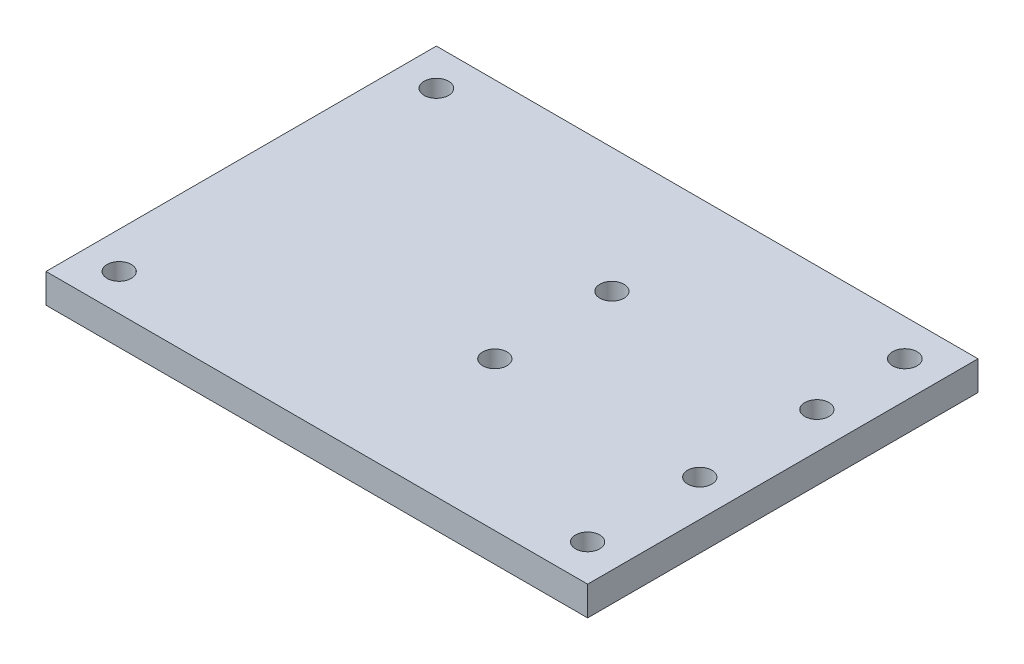
ISO-10303-21;
HEADER;
FILE_DESCRIPTION(('STEP AP214'),'2;1');
FILE_NAME('part.step','',(''),(''),'','','');
FILE_SCHEMA(('AUTOMOTIVE_DESIGN { 1 0 10303 214 1 1 1 1 }'));
ENDSEC;
DATA;
#1=APPLICATION_CONTEXT('core data for automotive mechanical design processes');
#2=APPLICATION_PROTOCOL_DEFINITION('international standard','automotive_design',2000,#1);
#3=PRODUCT_CONTEXT('',#1,'mechanical');
#4=PRODUCT('Part','Part','',(#3));
#5=PRODUCT_RELATED_PRODUCT_CATEGORY('part','',(#4));
#6=PRODUCT_DEFINITION_FORMATION('','',#4);
#7=PRODUCT_DEFINITION_CONTEXT('part definition',#1,'design');
#8=PRODUCT_DEFINITION('design','',#6,#7);
#9=PRODUCT_DEFINITION_SHAPE('','',#8);
#10=(LENGTH_UNIT() NAMED_UNIT(*) SI_UNIT(.MILLI.,.METRE.));
#11=(NAMED_UNIT(*) PLANE_ANGLE_UNIT() SI_UNIT($,.RADIAN.));
#12=(NAMED_UNIT(*) SI_UNIT($,.STERADIAN.) SOLID_ANGLE_UNIT());
#13=UNCERTAINTY_MEASURE_WITH_UNIT(LENGTH_MEASURE(1.E-05),#10,'distance_accuracy_value','');
#14=(GEOMETRIC_REPRESENTATION_CONTEXT(3) GLOBAL_UNCERTAINTY_ASSIGNED_CONTEXT((#13)) GLOBAL_UNIT_ASSIGNED_CONTEXT((#10,
#11,#12)) REPRESENTATION_CONTEXT('',''));
#15=CARTESIAN_POINT('',(0.,0.,0.));
#16=DIRECTION('',(0.,0.,1.));
#17=DIRECTION('',(1.,0.,0.));
#18=AXIS2_PLACEMENT_3D('',#15,#16,#17);
#19=CARTESIAN_POINT('',(0.,6.35,0.));
#20=DIRECTION('',(0.,-1.,0.));
#21=DIRECTION('',(0.,0.,-1.));
#22=AXIS2_PLACEMENT_3D('',#19,#20,#21);
#23=PLANE('',#22);
#24=CARTESIAN_POINT('',(65.0875,6.35,-32.2567904141238));
#25=DIRECTION('',(0.,1.,0.));
#26=DIRECTION('',(0.,0.,1.));
#27=AXIS2_PLACEMENT_3D('',#24,#25,#26);
#28=CIRCLE('',#27,2.62890000000001);
#29=CARTESIAN_POINT('',(65.0875,6.35,-29.6278904141238));
#30=VERTEX_POINT('',#29);
#31=EDGE_CURVE('E169',#30,#30,#28,.T.);
#32=ORIENTED_EDGE('',*,*,#31,.F.);
#33=EDGE_LOOP('',(#32));
#34=FACE_BOUND('',#33,.T.);
#35=CARTESIAN_POINT('',(65.0875,6.35,-57.6567904141238));
#36=DIRECTION('',(0.,1.,0.));
#37=DIRECTION('',(0.,0.,1.));
#38=AXIS2_PLACEMENT_3D('',#35,#36,#37);
#39=CIRCLE('',#38,2.62890000000001);
#40=CARTESIAN_POINT('',(65.0875,6.35,-55.0278904141238));
#41=VERTEX_POINT('',#40);
#42=EDGE_CURVE('E177',#41,#41,#39,.T.);
#43=ORIENTED_EDGE('',*,*,#42,.F.);
#44=EDGE_LOOP('',(#43));
#45=FACE_BOUND('',#44,.T.);
#46=CARTESIAN_POINT('',(109.5375,6.35,-57.6567904141238));
#47=DIRECTION('',(0.,1.,0.));
#48=DIRECTION('',(0.,0.,1.));
#49=AXIS2_PLACEMENT_3D('',#46,#47,#48);
#50=CIRCLE('',#49,2.62890000000001);
#51=CARTESIAN_POINT('',(109.5375,6.35,-55.0278904141238));
#52=VERTEX_POINT('',#51);
#53=EDGE_CURVE('E185',#52,#52,#50,.T.);
#54=ORIENTED_EDGE('',*,*,#53,.F.);
#55=EDGE_LOOP('',(#54));
#56=FACE_BOUND('',#55,.T.);
#57=CARTESIAN_POINT('',(109.5375,6.35,-32.2567904141238));
#58=DIRECTION('',(0.,1.,0.));
#59=DIRECTION('',(0.,0.,1.));
#60=AXIS2_PLACEMENT_3D('',#57,#58,#59);
#61=CIRCLE('',#60,2.62890000000001);
#62=CARTESIAN_POINT('',(109.5375,6.35,-29.6278904141238));
#63=VERTEX_POINT('',#62);
#64=EDGE_CURVE('E161',#63,#63,#61,.T.);
#65=ORIENTED_EDGE('',*,*,#64,.F.);
#66=EDGE_LOOP('',(#65));
#67=FACE_BOUND('',#66,.T.);
#68=DIRECTION('',(0.,0.,1.));
#69=VECTOR('',#68,1.);
#70=CARTESIAN_POINT('',(0.,6.35,0.));
#71=LINE('',#70,#69);
#72=CARTESIAN_POINT('',(0.,6.35,-84.668868));
#73=VERTEX_POINT('',#72);
#74=CARTESIAN_POINT('',(0.,6.35,0.));
#75=VERTEX_POINT('',#74);
#76=EDGE_CURVE('E91',#73,#75,#71,.T.);
#77=ORIENTED_EDGE('',*,*,#76,.T.);
#78=DIRECTION('',(1.,0.,0.));
#79=VECTOR('',#78,1.);
#80=CARTESIAN_POINT('',(0.,6.35,0.));
#81=LINE('',#80,#79);
#82=CARTESIAN_POINT('',(117.475,6.35,0.));
#83=VERTEX_POINT('',#82);
#84=EDGE_CURVE('E86',#75,#83,#81,.T.);
#85=ORIENTED_EDGE('',*,*,#84,.T.);
#86=DIRECTION('',(0.,0.,-1.));
#87=VECTOR('',#86,1.);
#88=CARTESIAN_POINT('',(117.475,6.35,0.));
#89=LINE('',#88,#87);
#90=CARTESIAN_POINT('',(117.475,6.35,-84.668868));
#91=VERTEX_POINT('',#90);
#92=EDGE_CURVE('E89',#83,#91,#89,.T.);
#93=ORIENTED_EDGE('',*,*,#92,.T.);
#94=DIRECTION('',(-1.,0.,0.));
#95=VECTOR('',#94,1.);
#96=CARTESIAN_POINT('',(0.,6.35,-84.668868));
#97=LINE('',#96,#95);
#98=EDGE_CURVE('E56',#91,#73,#97,.T.);
#99=ORIENTED_EDGE('',*,*,#98,.T.);
#100=EDGE_LOOP('',(#77,#85,#93,#99));
#101=FACE_BOUND('',#100,.T.);
#102=CARTESIAN_POINT('',(7.9375,6.35,-7.9375));
#103=DIRECTION('',(0.,1.,0.));
#104=DIRECTION('',(0.,0.,1.));
#105=AXIS2_PLACEMENT_3D('',#102,#103,#104);
#106=CIRCLE('',#105,2.6289);
#107=CARTESIAN_POINT('',(7.9375,6.35,-5.3086));
#108=VERTEX_POINT('',#107);
#109=EDGE_CURVE('E111',#108,#108,#106,.T.);
#110=ORIENTED_EDGE('',*,*,#109,.F.);
#111=EDGE_LOOP('',(#110));
#112=FACE_BOUND('',#111,.T.);
#113=CARTESIAN_POINT('',(109.5375,6.35,-7.9375));
#114=DIRECTION('',(0.,1.,0.));
#115=DIRECTION('',(0.,0.,1.));
#116=AXIS2_PLACEMENT_3D('',#113,#114,#115);
#117=CIRCLE('',#116,2.62890000000001);
#118=CARTESIAN_POINT('',(109.5375,6.35,-5.30859999999999));
#119=VERTEX_POINT('',#118);
#120=EDGE_CURVE('E133',#119,#119,#117,.T.);
#121=ORIENTED_EDGE('',*,*,#120,.F.);
#122=EDGE_LOOP('',(#121));
#123=FACE_BOUND('',#122,.T.);
#124=CARTESIAN_POINT('',(7.9375,6.35,-76.731368));
#125=DIRECTION('',(0.,1.,0.));
#126=DIRECTION('',(0.,0.,1.));
#127=AXIS2_PLACEMENT_3D('',#124,#125,#126);
#128=CIRCLE('',#127,2.667);
#129=CARTESIAN_POINT('',(7.9375,6.35,-74.064368));
#130=VERTEX_POINT('',#129);
#131=EDGE_CURVE('E141',#130,#130,#128,.T.);
#132=ORIENTED_EDGE('',*,*,#131,.F.);
#133=EDGE_LOOP('',(#132));
#134=FACE_BOUND('',#133,.T.);
#135=CARTESIAN_POINT('',(109.5375,6.35,-76.731368));
#136=DIRECTION('',(0.,1.,0.));
#137=DIRECTION('',(0.,0.,-1.));
#138=AXIS2_PLACEMENT_3D('',#135,#136,#137);
#139=CIRCLE('',#138,2.667);
#140=CARTESIAN_POINT('',(109.5375,6.35,-79.398368));
#141=VERTEX_POINT('',#140);
#142=EDGE_CURVE('E149',#141,#141,#139,.T.);
#143=ORIENTED_EDGE('',*,*,#142,.F.);
#144=EDGE_LOOP('',(#143));
#145=FACE_BOUND('',#144,.T.);
#146=ADVANCED_FACE('F38',(#34,#45,#56,#67,#101,#112,#123,#134,#145),#23,.F.);
#147=CARTESIAN_POINT('',(0.,0.,0.));
#148=DIRECTION('',(0.,-1.,0.));
#149=DIRECTION('',(0.,0.,-1.));
#150=AXIS2_PLACEMENT_3D('',#147,#148,#149);
#151=PLANE('',#150);
#152=CARTESIAN_POINT('',(65.0875,0.,-32.2567904141238));
#153=DIRECTION('',(0.,1.,0.));
#154=DIRECTION('',(0.,0.,1.));
#155=AXIS2_PLACEMENT_3D('',#152,#153,#154);
#156=CIRCLE('',#155,2.62890000000001);
#157=CARTESIAN_POINT('',(65.0875,0.,-29.6278904141238));
#158=VERTEX_POINT('',#157);
#159=EDGE_CURVE('E173',#158,#158,#156,.T.);
#160=ORIENTED_EDGE('',*,*,#159,.T.);
#161=EDGE_LOOP('',(#160));
#162=FACE_BOUND('',#161,.T.);
#163=CARTESIAN_POINT('',(65.0875,0.,-57.6567904141238));
#164=DIRECTION('',(0.,1.,0.));
#165=DIRECTION('',(0.,0.,1.));
#166=AXIS2_PLACEMENT_3D('',#163,#164,#165);
#167=CIRCLE('',#166,2.62890000000001);
#168=CARTESIAN_POINT('',(65.0875,0.,-55.0278904141238));
#169=VERTEX_POINT('',#168);
#170=EDGE_CURVE('E181',#169,#169,#167,.T.);
#171=ORIENTED_EDGE('',*,*,#170,.T.);
#172=EDGE_LOOP('',(#171));
#173=FACE_BOUND('',#172,.T.);
#174=CARTESIAN_POINT('',(109.5375,0.,-57.6567904141238));
#175=DIRECTION('',(0.,1.,0.));
#176=DIRECTION('',(0.,0.,1.));
#177=AXIS2_PLACEMENT_3D('',#174,#175,#176);
#178=CIRCLE('',#177,2.62890000000001);
#179=CARTESIAN_POINT('',(109.5375,0.,-55.0278904141238));
#180=VERTEX_POINT('',#179);
#181=EDGE_CURVE('E165',#180,#180,#178,.T.);
#182=ORIENTED_EDGE('',*,*,#181,.T.);
#183=EDGE_LOOP('',(#182));
#184=FACE_BOUND('',#183,.T.);
#185=CARTESIAN_POINT('',(109.5375,0.,-32.2567904141238));
#186=DIRECTION('',(0.,1.,0.));
#187=DIRECTION('',(0.,0.,1.));
#188=AXIS2_PLACEMENT_3D('',#185,#186,#187);
#189=CIRCLE('',#188,2.62890000000001);
#190=CARTESIAN_POINT('',(109.5375,0.,-29.6278904141238));
#191=VERTEX_POINT('',#190);
#192=EDGE_CURVE('E157',#191,#191,#189,.T.);
#193=ORIENTED_EDGE('',*,*,#192,.T.);
#194=EDGE_LOOP('',(#193));
#195=FACE_BOUND('',#194,.T.);
#196=CARTESIAN_POINT('',(7.9375,0.,-76.731368));
#197=DIRECTION('',(0.,1.,0.));
#198=DIRECTION('',(0.,0.,1.));
#199=AXIS2_PLACEMENT_3D('',#196,#197,#198);
#200=CIRCLE('',#199,2.667);
#201=CARTESIAN_POINT('',(7.9375,0.,-74.064368));
#202=VERTEX_POINT('',#201);
#203=EDGE_CURVE('E145',#202,#202,#200,.T.);
#204=ORIENTED_EDGE('',*,*,#203,.T.);
#205=EDGE_LOOP('',(#204));
#206=FACE_BOUND('',#205,.T.);
#207=CARTESIAN_POINT('',(7.9375,0.,-7.9375));
#208=DIRECTION('',(0.,1.,0.));
#209=DIRECTION('',(0.,0.,1.));
#210=AXIS2_PLACEMENT_3D('',#207,#208,#209);
#211=CIRCLE('',#210,2.6289);
#212=CARTESIAN_POINT('',(7.9375,0.,-5.3086));
#213=VERTEX_POINT('',#212);
#214=EDGE_CURVE('E129',#213,#213,#211,.T.);
#215=ORIENTED_EDGE('',*,*,#214,.T.);
#216=EDGE_LOOP('',(#215));
#217=FACE_BOUND('',#216,.T.);
#218=DIRECTION('',(0.,0.,1.));
#219=VECTOR('',#218,1.);
#220=CARTESIAN_POINT('',(0.,0.,0.));
#221=LINE('',#220,#219);
#222=CARTESIAN_POINT('',(0.,0.,-84.668868));
#223=VERTEX_POINT('',#222);
#224=CARTESIAN_POINT('',(0.,0.,0.));
#225=VERTEX_POINT('',#224);
#226=EDGE_CURVE('E107',#223,#225,#221,.T.);
#227=ORIENTED_EDGE('',*,*,#226,.F.);
#228=DIRECTION('',(-1.,0.,0.));
#229=VECTOR('',#228,1.);
#230=CARTESIAN_POINT('',(0.,0.,-84.668868));
#231=LINE('',#230,#229);
#232=CARTESIAN_POINT('',(117.475,0.,-84.668868));
#233=VERTEX_POINT('',#232);
#234=EDGE_CURVE('E79',#233,#223,#231,.T.);
#235=ORIENTED_EDGE('',*,*,#234,.F.);
#236=DIRECTION('',(0.,0.,-1.));
#237=VECTOR('',#236,1.);
#238=CARTESIAN_POINT('',(117.475,0.,0.));
#239=LINE('',#238,#237);
#240=CARTESIAN_POINT('',(117.475,0.,0.));
#241=VERTEX_POINT('',#240);
#242=EDGE_CURVE('E73',#241,#233,#239,.T.);
#243=ORIENTED_EDGE('',*,*,#242,.F.);
#244=DIRECTION('',(1.,0.,0.));
#245=VECTOR('',#244,1.);
#246=CARTESIAN_POINT('',(0.,0.,0.));
#247=LINE('',#246,#245);
#248=EDGE_CURVE('E96',#225,#241,#247,.T.);
#249=ORIENTED_EDGE('',*,*,#248,.F.);
#250=EDGE_LOOP('',(#227,#235,#243,#249));
#251=FACE_BOUND('',#250,.T.);
#252=CARTESIAN_POINT('',(109.5375,0.,-7.9375));
#253=DIRECTION('',(0.,1.,0.));
#254=DIRECTION('',(0.,0.,1.));
#255=AXIS2_PLACEMENT_3D('',#252,#253,#254);
#256=CIRCLE('',#255,2.62890000000001);
#257=CARTESIAN_POINT('',(109.5375,0.,-5.30859999999999));
#258=VERTEX_POINT('',#257);
#259=EDGE_CURVE('E137',#258,#258,#256,.T.);
#260=ORIENTED_EDGE('',*,*,#259,.T.);
#261=EDGE_LOOP('',(#260));
#262=FACE_BOUND('',#261,.T.);
#263=CARTESIAN_POINT('',(109.5375,0.,-76.731368));
#264=DIRECTION('',(0.,1.,0.));
#265=DIRECTION('',(0.,0.,-1.));
#266=AXIS2_PLACEMENT_3D('',#263,#264,#265);
#267=CIRCLE('',#266,2.667);
#268=CARTESIAN_POINT('',(109.5375,0.,-79.398368));
#269=VERTEX_POINT('',#268);
#270=EDGE_CURVE('E153',#269,#269,#267,.T.);
#271=ORIENTED_EDGE('',*,*,#270,.T.);
#272=EDGE_LOOP('',(#271));
#273=FACE_BOUND('',#272,.T.);
#274=ADVANCED_FACE('F124',(#162,#173,#184,#195,#206,#217,#251,#262,#273),#151,.T.);
#275=CARTESIAN_POINT('',(0.,6.35,0.));
#276=DIRECTION('',(1.,0.,0.));
#277=DIRECTION('',(0.,0.,-1.));
#278=AXIS2_PLACEMENT_3D('',#275,#276,#277);
#279=PLANE('',#278);
#280=ORIENTED_EDGE('',*,*,#226,.T.);
#281=DIRECTION('',(0.,-1.,0.));
#282=VECTOR('',#281,1.);
#283=CARTESIAN_POINT('',(0.,6.35,0.));
#284=LINE('',#283,#282);
#285=EDGE_CURVE('E11',#75,#225,#284,.T.);
#286=ORIENTED_EDGE('',*,*,#285,.F.);
#287=ORIENTED_EDGE('',*,*,#76,.F.);
#288=DIRECTION('',(0.,-1.,0.));
#289=VECTOR('',#288,1.);
#290=CARTESIAN_POINT('',(0.,6.35,-84.668868));
#291=LINE('',#290,#289);
#292=EDGE_CURVE('E103',#73,#223,#291,.T.);
#293=ORIENTED_EDGE('',*,*,#292,.T.);
#294=EDGE_LOOP('',(#280,#286,#287,#293));
#295=FACE_BOUND('',#294,.T.);
#296=ADVANCED_FACE('F40',(#295),#279,.F.);
#297=CARTESIAN_POINT('',(0.,6.35,0.));
#298=DIRECTION('',(0.,0.,-1.));
#299=DIRECTION('',(-1.,0.,0.));
#300=AXIS2_PLACEMENT_3D('',#297,#298,#299);
#301=PLANE('',#300);
#302=ORIENTED_EDGE('',*,*,#248,.T.);
#303=DIRECTION('',(0.,-1.,0.));
#304=VECTOR('',#303,1.);
#305=CARTESIAN_POINT('',(117.475,6.35,0.));
#306=LINE('',#305,#304);
#307=EDGE_CURVE('E48',#83,#241,#306,.T.);
#308=ORIENTED_EDGE('',*,*,#307,.F.);
#309=ORIENTED_EDGE('',*,*,#84,.F.);
#310=ORIENTED_EDGE('',*,*,#285,.T.);
#311=EDGE_LOOP('',(#302,#308,#309,#310));
#312=FACE_BOUND('',#311,.T.);
#313=ADVANCED_FACE('F95',(#312),#301,.F.);
#314=CARTESIAN_POINT('',(117.475,6.35,0.));
#315=DIRECTION('',(-1.,0.,0.));
#316=DIRECTION('',(0.,0.,1.));
#317=AXIS2_PLACEMENT_3D('',#314,#315,#316);
#318=PLANE('',#317);
#319=ORIENTED_EDGE('',*,*,#242,.T.);
#320=DIRECTION('',(0.,-1.,0.));
#321=VECTOR('',#320,1.);
#322=CARTESIAN_POINT('',(117.475,6.35,-84.668868));
#323=LINE('',#322,#321);
#324=EDGE_CURVE('E98',#91,#233,#323,.T.);
#325=ORIENTED_EDGE('',*,*,#324,.F.);
#326=ORIENTED_EDGE('',*,*,#92,.F.);
#327=ORIENTED_EDGE('',*,*,#307,.T.);
#328=EDGE_LOOP('',(#319,#325,#326,#327));
#329=FACE_BOUND('',#328,.T.);
#330=ADVANCED_FACE('F99',(#329),#318,.F.);
#331=CARTESIAN_POINT('',(0.,6.35,-84.668868));
#332=DIRECTION('',(0.,0.,1.));
#333=DIRECTION('',(1.,0.,0.));
#334=AXIS2_PLACEMENT_3D('',#331,#332,#333);
#335=PLANE('',#334);
#336=ORIENTED_EDGE('',*,*,#234,.T.);
#337=ORIENTED_EDGE('',*,*,#292,.F.);
#338=ORIENTED_EDGE('',*,*,#98,.F.);
#339=ORIENTED_EDGE('',*,*,#324,.T.);
#340=EDGE_LOOP('',(#336,#337,#338,#339));
#341=FACE_BOUND('',#340,.T.);
#342=ADVANCED_FACE('F121',(#341),#335,.F.);
#343=CARTESIAN_POINT('',(7.9375,6.35,-7.9375));
#344=DIRECTION('',(0.,-1.,0.));
#345=DIRECTION('',(0.,0.,-1.));
#346=AXIS2_PLACEMENT_3D('',#343,#344,#345);
#347=CYLINDRICAL_SURFACE('',#346,2.6289);
#348=ORIENTED_EDGE('',*,*,#109,.T.);
#349=EDGE_LOOP('',(#348));
#350=FACE_BOUND('',#349,.T.);
#351=ORIENTED_EDGE('',*,*,#214,.F.);
#352=EDGE_LOOP('',(#351));
#353=FACE_BOUND('',#352,.T.);
#354=ADVANCED_FACE('F230',(#350,#353),#347,.F.);
#355=CARTESIAN_POINT('',(109.5375,6.35,-7.9375));
#356=DIRECTION('',(0.,-1.,0.));
#357=DIRECTION('',(0.,0.,-1.));
#358=AXIS2_PLACEMENT_3D('',#355,#356,#357);
#359=CYLINDRICAL_SURFACE('',#358,2.62890000000001);
#360=ORIENTED_EDGE('',*,*,#120,.T.);
#361=EDGE_LOOP('',(#360));
#362=FACE_BOUND('',#361,.T.);
#363=ORIENTED_EDGE('',*,*,#259,.F.);
#364=EDGE_LOOP('',(#363));
#365=FACE_BOUND('',#364,.T.);
#366=ADVANCED_FACE('F226',(#362,#365),#359,.F.);
#367=CARTESIAN_POINT('',(7.9375,6.35,-76.731368));
#368=DIRECTION('',(0.,-1.,0.));
#369=DIRECTION('',(0.,0.,-1.));
#370=AXIS2_PLACEMENT_3D('',#367,#368,#369);
#371=CYLINDRICAL_SURFACE('',#370,2.667);
#372=ORIENTED_EDGE('',*,*,#131,.T.);
#373=EDGE_LOOP('',(#372));
#374=FACE_BOUND('',#373,.T.);
#375=ORIENTED_EDGE('',*,*,#203,.F.);
#376=EDGE_LOOP('',(#375));
#377=FACE_BOUND('',#376,.T.);
#378=ADVANCED_FACE('F216',(#374,#377),#371,.F.);
#379=CARTESIAN_POINT('',(109.5375,6.35,-76.731368));
#380=DIRECTION('',(0.,-1.,0.));
#381=DIRECTION('',(0.,0.,-1.));
#382=AXIS2_PLACEMENT_3D('',#379,#380,#381);
#383=CYLINDRICAL_SURFACE('',#382,2.667);
#384=ORIENTED_EDGE('',*,*,#142,.T.);
#385=EDGE_LOOP('',(#384));
#386=FACE_BOUND('',#385,.T.);
#387=ORIENTED_EDGE('',*,*,#270,.F.);
#388=EDGE_LOOP('',(#387));
#389=FACE_BOUND('',#388,.T.);
#390=ADVANCED_FACE('F210',(#386,#389),#383,.F.);
#391=CARTESIAN_POINT('',(109.5375,0.,-32.2567904141238));
#392=DIRECTION('',(0.,1.,0.));
#393=DIRECTION('',(0.,0.,1.));
#394=AXIS2_PLACEMENT_3D('',#391,#392,#393);
#395=CYLINDRICAL_SURFACE('',#394,2.62890000000001);
#396=ORIENTED_EDGE('',*,*,#192,.F.);
#397=EDGE_LOOP('',(#396));
#398=FACE_BOUND('',#397,.T.);
#399=ORIENTED_EDGE('',*,*,#64,.T.);
#400=EDGE_LOOP('',(#399));
#401=FACE_BOUND('',#400,.T.);
#402=ADVANCED_FACE('F199',(#398,#401),#395,.F.);
#403=CARTESIAN_POINT('',(109.5375,0.,-57.6567904141238));
#404=DIRECTION('',(0.,1.,0.));
#405=DIRECTION('',(0.,0.,1.));
#406=AXIS2_PLACEMENT_3D('',#403,#404,#405);
#407=CYLINDRICAL_SURFACE('',#406,2.62890000000001);
#408=ORIENTED_EDGE('',*,*,#181,.F.);
#409=EDGE_LOOP('',(#408));
#410=FACE_BOUND('',#409,.T.);
#411=ORIENTED_EDGE('',*,*,#53,.T.);
#412=EDGE_LOOP('',(#411));
#413=FACE_BOUND('',#412,.T.);
#414=ADVANCED_FACE('F195',(#410,#413),#407,.F.);
#415=CARTESIAN_POINT('',(65.0875,0.,-57.6567904141238));
#416=DIRECTION('',(0.,1.,0.));
#417=DIRECTION('',(0.,0.,1.));
#418=AXIS2_PLACEMENT_3D('',#415,#416,#417);
#419=CYLINDRICAL_SURFACE('',#418,2.62890000000001);
#420=ORIENTED_EDGE('',*,*,#170,.F.);
#421=EDGE_LOOP('',(#420));
#422=FACE_BOUND('',#421,.T.);
#423=ORIENTED_EDGE('',*,*,#42,.T.);
#424=EDGE_LOOP('',(#423));
#425=FACE_BOUND('',#424,.T.);
#426=ADVANCED_FACE('F198',(#422,#425),#419,.F.);
#427=CARTESIAN_POINT('',(65.0875,0.,-32.2567904141238));
#428=DIRECTION('',(0.,1.,0.));
#429=DIRECTION('',(0.,0.,1.));
#430=AXIS2_PLACEMENT_3D('',#427,#428,#429);
#431=CYLINDRICAL_SURFACE('',#430,2.62890000000001);
#432=ORIENTED_EDGE('',*,*,#159,.F.);
#433=EDGE_LOOP('',(#432));
#434=FACE_BOUND('',#433,.T.);
#435=ORIENTED_EDGE('',*,*,#31,.T.);
#436=EDGE_LOOP('',(#435));
#437=FACE_BOUND('',#436,.T.);
#438=ADVANCED_FACE('F221',(#434,#437),#431,.F.);
#439=CLOSED_SHELL('',(#146,#274,#296,#313,#330,#342,#354,#366,#378,#390,#402,#414,#426,#438));
#440=MANIFOLD_SOLID_BREP('B2',#439);
#441=ADVANCED_BREP_SHAPE_REPRESENTATION('',(#18,#440),#14);
#442=SHAPE_DEFINITION_REPRESENTATION(#9,#441);
ENDSEC;
END-ISO-10303-21;
